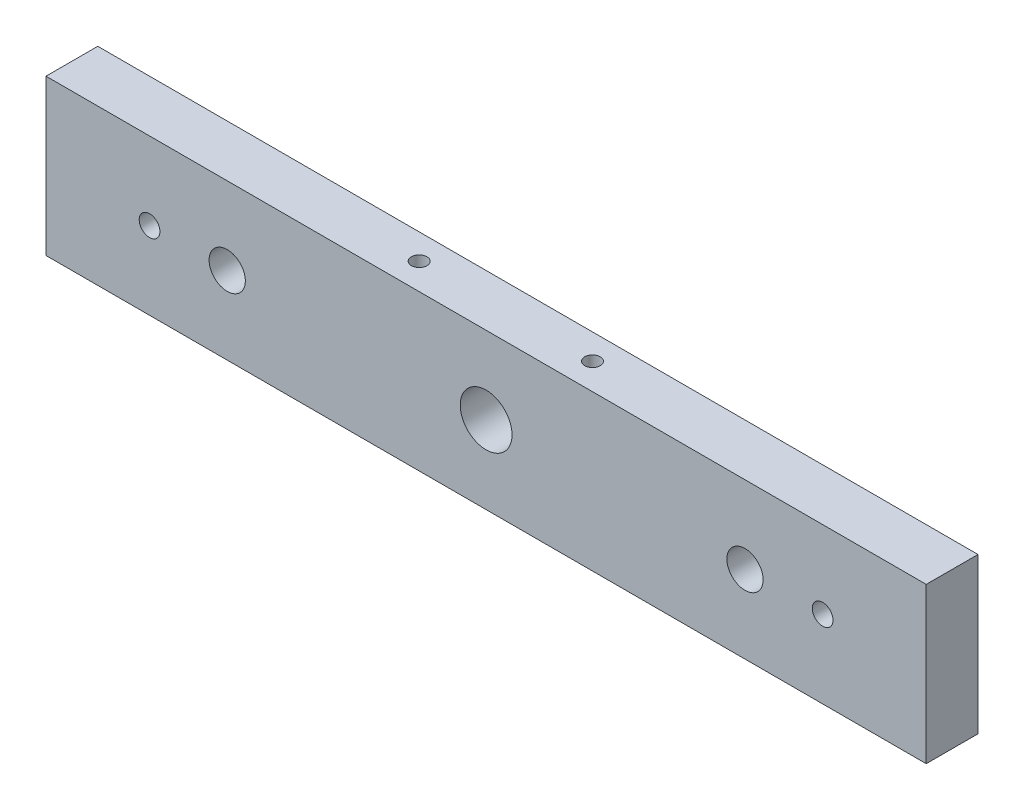
ISO-10303-21;
HEADER;
FILE_DESCRIPTION(('STEP AP214'),'2;1');
FILE_NAME('part.step','',(''),(''),'','','');
FILE_SCHEMA(('AUTOMOTIVE_DESIGN { 1 0 10303 214 1 1 1 1 }'));
ENDSEC;
DATA;
#1=APPLICATION_CONTEXT('core data for automotive mechanical design processes');
#2=APPLICATION_PROTOCOL_DEFINITION('international standard','automotive_design',2000,#1);
#3=PRODUCT_CONTEXT('',#1,'mechanical');
#4=PRODUCT('Part','Part','',(#3));
#5=PRODUCT_RELATED_PRODUCT_CATEGORY('part','',(#4));
#6=PRODUCT_DEFINITION_FORMATION('','',#4);
#7=PRODUCT_DEFINITION_CONTEXT('part definition',#1,'design');
#8=PRODUCT_DEFINITION('design','',#6,#7);
#9=PRODUCT_DEFINITION_SHAPE('','',#8);
#10=(LENGTH_UNIT() NAMED_UNIT(*) SI_UNIT(.MILLI.,.METRE.));
#11=(NAMED_UNIT(*) PLANE_ANGLE_UNIT() SI_UNIT($,.RADIAN.));
#12=(NAMED_UNIT(*) SI_UNIT($,.STERADIAN.) SOLID_ANGLE_UNIT());
#13=UNCERTAINTY_MEASURE_WITH_UNIT(LENGTH_MEASURE(1.E-05),#10,'distance_accuracy_value','');
#14=(GEOMETRIC_REPRESENTATION_CONTEXT(3) GLOBAL_UNCERTAINTY_ASSIGNED_CONTEXT((#13)) GLOBAL_UNIT_ASSIGNED_CONTEXT((#10,
#11,#12)) REPRESENTATION_CONTEXT('',''));
#15=CARTESIAN_POINT('',(0.,0.,0.));
#16=DIRECTION('',(0.,0.,1.));
#17=DIRECTION('',(1.,0.,0.));
#18=AXIS2_PLACEMENT_3D('',#15,#16,#17);
#19=CARTESIAN_POINT('',(-277.217741935484,26.4516129032258,10.));
#20=DIRECTION('',(0.,1.,0.));
#21=DIRECTION('',(0.,0.,1.));
#22=AXIS2_PLACEMENT_3D('',#19,#20,#21);
#23=PLANE('',#22);
#24=CARTESIAN_POINT('',(-210.232722869532,26.4516129032258,4.91811372302718));
#25=DIRECTION('',(0.,1.,0.));
#26=DIRECTION('',(0.,0.,1.));
#27=AXIS2_PLACEMENT_3D('',#24,#25,#26);
#28=CIRCLE('',#27,1.5);
#29=CARTESIAN_POINT('',(-210.232722869532,26.4516129032258,6.41811372302718));
#30=VERTEX_POINT('',#29);
#31=EDGE_CURVE('E113',#30,#30,#28,.F.);
#32=ORIENTED_EDGE('',*,*,#31,.F.);
#33=EDGE_LOOP('',(#32));
#34=FACE_BOUND('',#33,.T.);
#35=DIRECTION('',(1.,0.,0.));
#36=VECTOR('',#35,1.);
#37=CARTESIAN_POINT('',(-277.217741935484,26.4516129032258,0.));
#38=LINE('',#37,#36);
#39=CARTESIAN_POINT('',(-277.217741935484,26.4516129032258,0.));
#40=VERTEX_POINT('',#39);
#41=CARTESIAN_POINT('',(-107.217741935484,26.4516129032258,0.));
#42=VERTEX_POINT('',#41);
#43=EDGE_CURVE('E94',#40,#42,#38,.T.);
#44=ORIENTED_EDGE('',*,*,#43,.T.);
#45=DIRECTION('',(0.,0.,-1.));
#46=VECTOR('',#45,1.);
#47=CARTESIAN_POINT('',(-107.217741935484,26.4516129032258,10.));
#48=LINE('',#47,#46);
#49=CARTESIAN_POINT('',(-107.217741935484,26.4516129032258,10.));
#50=VERTEX_POINT('',#49);
#51=EDGE_CURVE('E45',#50,#42,#48,.T.);
#52=ORIENTED_EDGE('',*,*,#51,.F.);
#53=DIRECTION('',(1.,0.,0.));
#54=VECTOR('',#53,1.);
#55=CARTESIAN_POINT('',(-277.217741935484,26.4516129032258,10.));
#56=LINE('',#55,#54);
#57=CARTESIAN_POINT('',(-277.217741935484,26.4516129032258,10.));
#58=VERTEX_POINT('',#57);
#59=EDGE_CURVE('E84',#58,#50,#56,.T.);
#60=ORIENTED_EDGE('',*,*,#59,.F.);
#61=DIRECTION('',(0.,0.,-1.));
#62=VECTOR('',#61,1.);
#63=CARTESIAN_POINT('',(-277.217741935484,26.4516129032258,10.));
#64=LINE('',#63,#62);
#65=EDGE_CURVE('E12',#58,#40,#64,.T.);
#66=ORIENTED_EDGE('',*,*,#65,.T.);
#67=EDGE_LOOP('',(#44,#52,#60,#66));
#68=FACE_BOUND('',#67,.T.);
#69=CARTESIAN_POINT('',(-176.768107744617,26.4516129032258,4.91221798755203));
#70=DIRECTION('',(0.,1.,0.));
#71=DIRECTION('',(0.,0.,1.));
#72=AXIS2_PLACEMENT_3D('',#69,#70,#71);
#73=CIRCLE('',#72,1.5);
#74=CARTESIAN_POINT('',(-176.768107744617,26.4516129032258,6.41221798755203));
#75=VERTEX_POINT('',#74);
#76=EDGE_CURVE('E114',#75,#75,#73,.F.);
#77=ORIENTED_EDGE('',*,*,#76,.F.);
#78=EDGE_LOOP('',(#77));
#79=FACE_BOUND('',#78,.T.);
#80=ADVANCED_FACE('F35',(#34,#68,#79),#23,.F.);
#81=CARTESIAN_POINT('',(-277.217741935484,56.4516129032258,10.));
#82=DIRECTION('',(0.,-1.,0.));
#83=DIRECTION('',(0.,0.,-1.));
#84=AXIS2_PLACEMENT_3D('',#81,#82,#83);
#85=PLANE('',#84);
#86=CARTESIAN_POINT('',(-210.232722869532,56.4516129032258,4.91811372302718));
#87=DIRECTION('',(0.,-1.,0.));
#88=DIRECTION('',(0.,0.,-1.));
#89=AXIS2_PLACEMENT_3D('',#86,#87,#88);
#90=CIRCLE('',#89,1.5);
#91=CARTESIAN_POINT('',(-210.232722869532,56.4516129032258,3.41811372302718));
#92=VERTEX_POINT('',#91);
#93=EDGE_CURVE('E111',#92,#92,#90,.F.);
#94=ORIENTED_EDGE('',*,*,#93,.F.);
#95=EDGE_LOOP('',(#94));
#96=FACE_BOUND('',#95,.T.);
#97=DIRECTION('',(-1.,0.,0.));
#98=VECTOR('',#97,1.);
#99=CARTESIAN_POINT('',(-277.217741935484,56.4516129032258,0.));
#100=LINE('',#99,#98);
#101=CARTESIAN_POINT('',(-107.217741935484,56.4516129032258,0.));
#102=VERTEX_POINT('',#101);
#103=CARTESIAN_POINT('',(-277.217741935484,56.4516129032258,0.));
#104=VERTEX_POINT('',#103);
#105=EDGE_CURVE('E77',#102,#104,#100,.T.);
#106=ORIENTED_EDGE('',*,*,#105,.T.);
#107=DIRECTION('',(0.,0.,-1.));
#108=VECTOR('',#107,1.);
#109=CARTESIAN_POINT('',(-277.217741935484,56.4516129032258,10.));
#110=LINE('',#109,#108);
#111=CARTESIAN_POINT('',(-277.217741935484,56.4516129032258,10.));
#112=VERTEX_POINT('',#111);
#113=EDGE_CURVE('E99',#112,#104,#110,.T.);
#114=ORIENTED_EDGE('',*,*,#113,.F.);
#115=DIRECTION('',(-1.,0.,0.));
#116=VECTOR('',#115,1.);
#117=CARTESIAN_POINT('',(-277.217741935484,56.4516129032258,10.));
#118=LINE('',#117,#116);
#119=CARTESIAN_POINT('',(-107.217741935484,56.4516129032258,10.));
#120=VERTEX_POINT('',#119);
#121=EDGE_CURVE('E54',#120,#112,#118,.T.);
#122=ORIENTED_EDGE('',*,*,#121,.F.);
#123=DIRECTION('',(0.,0.,-1.));
#124=VECTOR('',#123,1.);
#125=CARTESIAN_POINT('',(-107.217741935484,56.4516129032258,10.));
#126=LINE('',#125,#124);
#127=EDGE_CURVE('E95',#120,#102,#126,.T.);
#128=ORIENTED_EDGE('',*,*,#127,.T.);
#129=EDGE_LOOP('',(#106,#114,#122,#128));
#130=FACE_BOUND('',#129,.T.);
#131=CARTESIAN_POINT('',(-176.768107744617,56.4516129032258,4.91221798755203));
#132=DIRECTION('',(0.,-1.,0.));
#133=DIRECTION('',(0.,0.,-1.));
#134=AXIS2_PLACEMENT_3D('',#131,#132,#133);
#135=CIRCLE('',#134,1.5);
#136=CARTESIAN_POINT('',(-176.768107744617,56.4516129032258,3.41221798755203));
#137=VERTEX_POINT('',#136);
#138=EDGE_CURVE('E39',#137,#137,#135,.F.);
#139=ORIENTED_EDGE('',*,*,#138,.F.);
#140=EDGE_LOOP('',(#139));
#141=FACE_BOUND('',#140,.T.);
#142=ADVANCED_FACE('F173',(#96,#130,#141),#85,.F.);
#143=CARTESIAN_POINT('',(0.,0.,10.));
#144=DIRECTION('',(0.,0.,1.));
#145=DIRECTION('',(1.,0.,0.));
#146=AXIS2_PLACEMENT_3D('',#143,#144,#145);
#147=PLANE('',#146);
#148=CARTESIAN_POINT('',(-142.217741935484,41.4516129032258,10.));
#149=DIRECTION('',(0.,0.,1.));
#150=DIRECTION('',(1.,0.,0.));
#151=AXIS2_PLACEMENT_3D('',#148,#149,#150);
#152=CIRCLE('',#151,3.49999999999999);
#153=CARTESIAN_POINT('',(-138.717741935484,41.4516129032258,10.));
#154=VERTEX_POINT('',#153);
#155=EDGE_CURVE('E132',#154,#154,#152,.T.);
#156=ORIENTED_EDGE('',*,*,#155,.F.);
#157=EDGE_LOOP('',(#156));
#158=FACE_BOUND('',#157,.T.);
#159=CARTESIAN_POINT('',(-257.217741935484,41.4516129032258,10.));
#160=DIRECTION('',(0.,0.,1.));
#161=DIRECTION('',(1.,0.,0.));
#162=AXIS2_PLACEMENT_3D('',#159,#160,#161);
#163=CIRCLE('',#162,2.);
#164=CARTESIAN_POINT('',(-255.217741935484,41.4516129032258,10.));
#165=VERTEX_POINT('',#164);
#166=EDGE_CURVE('E144',#165,#165,#163,.T.);
#167=ORIENTED_EDGE('',*,*,#166,.F.);
#168=EDGE_LOOP('',(#167));
#169=FACE_BOUND('',#168,.T.);
#170=DIRECTION('',(0.,-1.,0.));
#171=VECTOR('',#170,1.);
#172=CARTESIAN_POINT('',(-277.217741935484,56.4516129032258,10.));
#173=LINE('',#172,#171);
#174=EDGE_CURVE('E90',#112,#58,#173,.T.);
#175=ORIENTED_EDGE('',*,*,#174,.T.);
#176=ORIENTED_EDGE('',*,*,#59,.T.);
#177=DIRECTION('',(0.,1.,0.));
#178=VECTOR('',#177,1.);
#179=CARTESIAN_POINT('',(-107.217741935484,56.4516129032258,10.));
#180=LINE('',#179,#178);
#181=EDGE_CURVE('E88',#50,#120,#180,.T.);
#182=ORIENTED_EDGE('',*,*,#181,.T.);
#183=ORIENTED_EDGE('',*,*,#121,.T.);
#184=EDGE_LOOP('',(#175,#176,#182,#183));
#185=FACE_BOUND('',#184,.T.);
#186=CARTESIAN_POINT('',(-192.217741935484,41.4516129032258,10.));
#187=DIRECTION('',(0.,0.,1.));
#188=DIRECTION('',(1.,0.,0.));
#189=AXIS2_PLACEMENT_3D('',#186,#187,#188);
#190=CIRCLE('',#189,5.00000000000002);
#191=CARTESIAN_POINT('',(-187.217741935484,41.4516129032258,10.));
#192=VERTEX_POINT('',#191);
#193=EDGE_CURVE('E106',#192,#192,#190,.T.);
#194=ORIENTED_EDGE('',*,*,#193,.F.);
#195=EDGE_LOOP('',(#194));
#196=FACE_BOUND('',#195,.T.);
#197=CARTESIAN_POINT('',(-242.217741935484,41.4516129032258,10.));
#198=DIRECTION('',(0.,0.,1.));
#199=DIRECTION('',(1.,0.,0.));
#200=AXIS2_PLACEMENT_3D('',#197,#198,#199);
#201=CIRCLE('',#200,3.50000000000002);
#202=CARTESIAN_POINT('',(-238.717741935484,41.4516129032258,10.));
#203=VERTEX_POINT('',#202);
#204=EDGE_CURVE('E138',#203,#203,#201,.T.);
#205=ORIENTED_EDGE('',*,*,#204,.F.);
#206=EDGE_LOOP('',(#205));
#207=FACE_BOUND('',#206,.T.);
#208=CARTESIAN_POINT('',(-127.217741935484,41.4516129032258,10.));
#209=DIRECTION('',(0.,0.,1.));
#210=DIRECTION('',(1.,0.,0.));
#211=AXIS2_PLACEMENT_3D('',#208,#209,#210);
#212=CIRCLE('',#211,2.);
#213=CARTESIAN_POINT('',(-125.217741935484,41.4516129032258,10.));
#214=VERTEX_POINT('',#213);
#215=EDGE_CURVE('E126',#214,#214,#212,.T.);
#216=ORIENTED_EDGE('',*,*,#215,.F.);
#217=EDGE_LOOP('',(#216));
#218=FACE_BOUND('',#217,.T.);
#219=ADVANCED_FACE('F85',(#158,#169,#185,#196,#207,#218),#147,.T.);
#220=CARTESIAN_POINT('',(0.,0.,0.));
#221=DIRECTION('',(0.,0.,1.));
#222=DIRECTION('',(1.,0.,0.));
#223=AXIS2_PLACEMENT_3D('',#220,#221,#222);
#224=PLANE('',#223);
#225=CARTESIAN_POINT('',(-142.217741935484,41.4516129032258,0.));
#226=DIRECTION('',(0.,0.,1.));
#227=DIRECTION('',(1.,0.,0.));
#228=AXIS2_PLACEMENT_3D('',#225,#226,#227);
#229=CIRCLE('',#228,3.49999999999999);
#230=CARTESIAN_POINT('',(-138.717741935484,41.4516129032258,0.));
#231=VERTEX_POINT('',#230);
#232=EDGE_CURVE('E129',#231,#231,#229,.T.);
#233=ORIENTED_EDGE('',*,*,#232,.T.);
#234=EDGE_LOOP('',(#233));
#235=FACE_BOUND('',#234,.T.);
#236=CARTESIAN_POINT('',(-257.217741935484,41.4516129032258,0.));
#237=DIRECTION('',(0.,0.,1.));
#238=DIRECTION('',(1.,0.,0.));
#239=AXIS2_PLACEMENT_3D('',#236,#237,#238);
#240=CIRCLE('',#239,2.);
#241=CARTESIAN_POINT('',(-255.217741935484,41.4516129032258,0.));
#242=VERTEX_POINT('',#241);
#243=EDGE_CURVE('E141',#242,#242,#240,.T.);
#244=ORIENTED_EDGE('',*,*,#243,.T.);
#245=EDGE_LOOP('',(#244));
#246=FACE_BOUND('',#245,.T.);
#247=DIRECTION('',(0.,-1.,0.));
#248=VECTOR('',#247,1.);
#249=CARTESIAN_POINT('',(-277.217741935484,56.4516129032258,0.));
#250=LINE('',#249,#248);
#251=EDGE_CURVE('E103',#104,#40,#250,.T.);
#252=ORIENTED_EDGE('',*,*,#251,.F.);
#253=ORIENTED_EDGE('',*,*,#105,.F.);
#254=DIRECTION('',(0.,1.,0.));
#255=VECTOR('',#254,1.);
#256=CARTESIAN_POINT('',(-107.217741935484,56.4516129032258,0.));
#257=LINE('',#256,#255);
#258=EDGE_CURVE('E71',#42,#102,#257,.T.);
#259=ORIENTED_EDGE('',*,*,#258,.F.);
#260=ORIENTED_EDGE('',*,*,#43,.F.);
#261=EDGE_LOOP('',(#252,#253,#259,#260));
#262=FACE_BOUND('',#261,.T.);
#263=CARTESIAN_POINT('',(-192.217741935484,41.4516129032258,0.));
#264=DIRECTION('',(0.,0.,1.));
#265=DIRECTION('',(1.,0.,0.));
#266=AXIS2_PLACEMENT_3D('',#263,#264,#265);
#267=CIRCLE('',#266,5.00000000000002);
#268=CARTESIAN_POINT('',(-187.217741935484,41.4516129032258,0.));
#269=VERTEX_POINT('',#268);
#270=EDGE_CURVE('E147',#269,#269,#267,.T.);
#271=ORIENTED_EDGE('',*,*,#270,.T.);
#272=EDGE_LOOP('',(#271));
#273=FACE_BOUND('',#272,.T.);
#274=CARTESIAN_POINT('',(-242.217741935484,41.4516129032258,0.));
#275=DIRECTION('',(0.,0.,1.));
#276=DIRECTION('',(1.,0.,0.));
#277=AXIS2_PLACEMENT_3D('',#274,#275,#276);
#278=CIRCLE('',#277,3.50000000000002);
#279=CARTESIAN_POINT('',(-238.717741935484,41.4516129032258,0.));
#280=VERTEX_POINT('',#279);
#281=EDGE_CURVE('E135',#280,#280,#278,.T.);
#282=ORIENTED_EDGE('',*,*,#281,.T.);
#283=EDGE_LOOP('',(#282));
#284=FACE_BOUND('',#283,.T.);
#285=CARTESIAN_POINT('',(-127.217741935484,41.4516129032258,0.));
#286=DIRECTION('',(0.,0.,1.));
#287=DIRECTION('',(1.,0.,0.));
#288=AXIS2_PLACEMENT_3D('',#285,#286,#287);
#289=CIRCLE('',#288,2.);
#290=CARTESIAN_POINT('',(-125.217741935484,41.4516129032258,0.));
#291=VERTEX_POINT('',#290);
#292=EDGE_CURVE('E118',#291,#291,#289,.T.);
#293=ORIENTED_EDGE('',*,*,#292,.T.);
#294=EDGE_LOOP('',(#293));
#295=FACE_BOUND('',#294,.T.);
#296=ADVANCED_FACE('F155',(#235,#246,#262,#273,#284,#295),#224,.F.);
#297=CARTESIAN_POINT('',(-277.217741935484,56.4516129032258,10.));
#298=DIRECTION('',(1.,0.,0.));
#299=DIRECTION('',(0.,0.,-1.));
#300=AXIS2_PLACEMENT_3D('',#297,#298,#299);
#301=PLANE('',#300);
#302=ORIENTED_EDGE('',*,*,#251,.T.);
#303=ORIENTED_EDGE('',*,*,#65,.F.);
#304=ORIENTED_EDGE('',*,*,#174,.F.);
#305=ORIENTED_EDGE('',*,*,#113,.T.);
#306=EDGE_LOOP('',(#302,#303,#304,#305));
#307=FACE_BOUND('',#306,.T.);
#308=ADVANCED_FACE('F37',(#307),#301,.F.);
#309=CARTESIAN_POINT('',(-107.217741935484,56.4516129032258,10.));
#310=DIRECTION('',(-1.,0.,0.));
#311=DIRECTION('',(0.,0.,1.));
#312=AXIS2_PLACEMENT_3D('',#309,#310,#311);
#313=PLANE('',#312);
#314=ORIENTED_EDGE('',*,*,#258,.T.);
#315=ORIENTED_EDGE('',*,*,#127,.F.);
#316=ORIENTED_EDGE('',*,*,#181,.F.);
#317=ORIENTED_EDGE('',*,*,#51,.T.);
#318=EDGE_LOOP('',(#314,#315,#316,#317));
#319=FACE_BOUND('',#318,.T.);
#320=ADVANCED_FACE('F97',(#319),#313,.F.);
#321=CARTESIAN_POINT('',(-192.217741935484,41.4516129032258,10.));
#322=DIRECTION('',(0.,0.,-1.));
#323=DIRECTION('',(-1.,0.,0.));
#324=AXIS2_PLACEMENT_3D('',#321,#322,#323);
#325=CYLINDRICAL_SURFACE('',#324,5.00000000000002);
#326=ORIENTED_EDGE('',*,*,#193,.T.);
#327=EDGE_LOOP('',(#326));
#328=FACE_BOUND('',#327,.T.);
#329=ORIENTED_EDGE('',*,*,#270,.F.);
#330=EDGE_LOOP('',(#329));
#331=FACE_BOUND('',#330,.T.);
#332=ADVANCED_FACE('F158',(#328,#331),#325,.F.);
#333=CARTESIAN_POINT('',(-257.217741935484,41.4516129032258,10.));
#334=DIRECTION('',(0.,0.,-1.));
#335=DIRECTION('',(-1.,0.,0.));
#336=AXIS2_PLACEMENT_3D('',#333,#334,#335);
#337=CYLINDRICAL_SURFACE('',#336,2.);
#338=ORIENTED_EDGE('',*,*,#166,.T.);
#339=EDGE_LOOP('',(#338));
#340=FACE_BOUND('',#339,.T.);
#341=ORIENTED_EDGE('',*,*,#243,.F.);
#342=EDGE_LOOP('',(#341));
#343=FACE_BOUND('',#342,.T.);
#344=ADVANCED_FACE('F160',(#340,#343),#337,.F.);
#345=CARTESIAN_POINT('',(-242.217741935484,41.4516129032258,10.));
#346=DIRECTION('',(0.,0.,-1.));
#347=DIRECTION('',(-1.,0.,0.));
#348=AXIS2_PLACEMENT_3D('',#345,#346,#347);
#349=CYLINDRICAL_SURFACE('',#348,3.50000000000002);
#350=ORIENTED_EDGE('',*,*,#204,.T.);
#351=EDGE_LOOP('',(#350));
#352=FACE_BOUND('',#351,.T.);
#353=ORIENTED_EDGE('',*,*,#281,.F.);
#354=EDGE_LOOP('',(#353));
#355=FACE_BOUND('',#354,.T.);
#356=ADVANCED_FACE('F167',(#352,#355),#349,.F.);
#357=CARTESIAN_POINT('',(-142.217741935484,41.4516129032258,10.));
#358=DIRECTION('',(0.,0.,-1.));
#359=DIRECTION('',(-1.,0.,0.));
#360=AXIS2_PLACEMENT_3D('',#357,#358,#359);
#361=CYLINDRICAL_SURFACE('',#360,3.49999999999999);
#362=ORIENTED_EDGE('',*,*,#155,.T.);
#363=EDGE_LOOP('',(#362));
#364=FACE_BOUND('',#363,.T.);
#365=ORIENTED_EDGE('',*,*,#232,.F.);
#366=EDGE_LOOP('',(#365));
#367=FACE_BOUND('',#366,.T.);
#368=ADVANCED_FACE('F212',(#364,#367),#361,.F.);
#369=CARTESIAN_POINT('',(-127.217741935484,41.4516129032258,10.));
#370=DIRECTION('',(0.,0.,-1.));
#371=DIRECTION('',(-1.,0.,0.));
#372=AXIS2_PLACEMENT_3D('',#369,#370,#371);
#373=CYLINDRICAL_SURFACE('',#372,2.);
#374=ORIENTED_EDGE('',*,*,#215,.T.);
#375=EDGE_LOOP('',(#374));
#376=FACE_BOUND('',#375,.T.);
#377=ORIENTED_EDGE('',*,*,#292,.F.);
#378=EDGE_LOOP('',(#377));
#379=FACE_BOUND('',#378,.T.);
#380=ADVANCED_FACE('F207',(#376,#379),#373,.F.);
#381=CARTESIAN_POINT('',(-210.232722869532,32.4629956737243,4.91811372302718));
#382=DIRECTION('',(0.,-1.,0.));
#383=DIRECTION('',(0.,0.,-1.));
#384=AXIS2_PLACEMENT_3D('',#381,#382,#383);
#385=CYLINDRICAL_SURFACE('',#384,1.5);
#386=ORIENTED_EDGE('',*,*,#93,.T.);
#387=EDGE_LOOP('',(#386));
#388=FACE_BOUND('',#387,.T.);
#389=ORIENTED_EDGE('',*,*,#31,.T.);
#390=EDGE_LOOP('',(#389));
#391=FACE_BOUND('',#390,.T.);
#392=ADVANCED_FACE('F202',(#388,#391),#385,.F.);
#393=CARTESIAN_POINT('',(-176.768107744617,30.7358376342065,4.91221798755203));
#394=DIRECTION('',(0.,-1.,0.));
#395=DIRECTION('',(0.,0.,-1.));
#396=AXIS2_PLACEMENT_3D('',#393,#394,#395);
#397=CYLINDRICAL_SURFACE('',#396,1.5);
#398=ORIENTED_EDGE('',*,*,#138,.T.);
#399=EDGE_LOOP('',(#398));
#400=FACE_BOUND('',#399,.T.);
#401=ORIENTED_EDGE('',*,*,#76,.T.);
#402=EDGE_LOOP('',(#401));
#403=FACE_BOUND('',#402,.T.);
#404=ADVANCED_FACE('F200',(#400,#403),#397,.F.);
#405=CLOSED_SHELL('',(#80,#142,#219,#296,#308,#320,#332,#344,#356,#368,#380,#392,#404));
#406=MANIFOLD_SOLID_BREP('B2',#405);
#407=ADVANCED_BREP_SHAPE_REPRESENTATION('',(#18,#406),#14);
#408=SHAPE_DEFINITION_REPRESENTATION(#9,#407);
ENDSEC;
END-ISO-10303-21;
